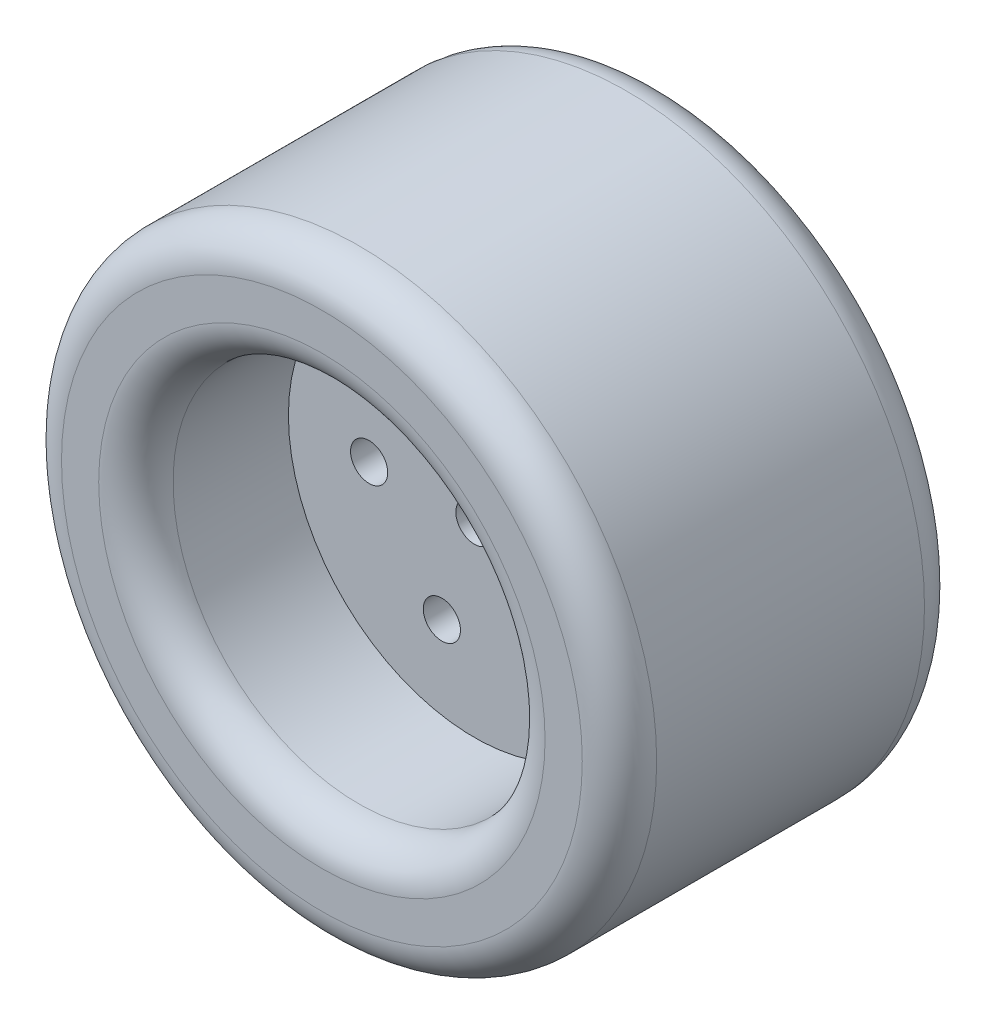
ISO-10303-21;
HEADER;
FILE_DESCRIPTION(('STEP AP214'),'2;1');
FILE_NAME('part.step','',(''),(''),'','','');
FILE_SCHEMA(('AUTOMOTIVE_DESIGN { 1 0 10303 214 1 1 1 1 }'));
ENDSEC;
DATA;
#1=APPLICATION_CONTEXT('core data for automotive mechanical design processes');
#2=APPLICATION_PROTOCOL_DEFINITION('international standard','automotive_design',2000,#1);
#3=PRODUCT_CONTEXT('',#1,'mechanical');
#4=PRODUCT('Part','Part','',(#3));
#5=PRODUCT_RELATED_PRODUCT_CATEGORY('part','',(#4));
#6=PRODUCT_DEFINITION_FORMATION('','',#4);
#7=PRODUCT_DEFINITION_CONTEXT('part definition',#1,'design');
#8=PRODUCT_DEFINITION('design','',#6,#7);
#9=PRODUCT_DEFINITION_SHAPE('','',#8);
#10=(LENGTH_UNIT() NAMED_UNIT(*) SI_UNIT(.MILLI.,.METRE.));
#11=(NAMED_UNIT(*) PLANE_ANGLE_UNIT() SI_UNIT($,.RADIAN.));
#12=(NAMED_UNIT(*) SI_UNIT($,.STERADIAN.) SOLID_ANGLE_UNIT());
#13=UNCERTAINTY_MEASURE_WITH_UNIT(LENGTH_MEASURE(1.E-05),#10,'distance_accuracy_value','');
#14=(GEOMETRIC_REPRESENTATION_CONTEXT(3) GLOBAL_UNCERTAINTY_ASSIGNED_CONTEXT((#13)) GLOBAL_UNIT_ASSIGNED_CONTEXT((#10,
#11,#12)) REPRESENTATION_CONTEXT('',''));
#15=CARTESIAN_POINT('',(0.,0.,0.));
#16=DIRECTION('',(0.,0.,1.));
#17=DIRECTION('',(1.,0.,0.));
#18=AXIS2_PLACEMENT_3D('',#15,#16,#17);
#19=CARTESIAN_POINT('',(0.,0.,-2.54));
#20=DIRECTION('',(0.,0.,1.));
#21=DIRECTION('',(1.,0.,0.));
#22=AXIS2_PLACEMENT_3D('',#19,#20,#21);
#23=CYLINDRICAL_SURFACE('',#22,63.5);
#24=CARTESIAN_POINT('',(0.,0.,101.6));
#25=DIRECTION('',(0.,0.,1.));
#26=DIRECTION('',(1.,0.,0.));
#27=AXIS2_PLACEMENT_3D('',#24,#25,#26);
#28=CIRCLE('',#27,63.5);
#29=CARTESIAN_POINT('',(63.5,0.,101.6));
#30=VERTEX_POINT('',#29);
#31=EDGE_CURVE('E91',#30,#30,#28,.T.);
#32=ORIENTED_EDGE('',*,*,#31,.T.);
#33=EDGE_LOOP('',(#32));
#34=FACE_BOUND('',#33,.T.);
#35=CARTESIAN_POINT('',(0.,0.,62.23));
#36=DIRECTION('',(0.,0.,-1.));
#37=DIRECTION('',(-1.,0.,0.));
#38=AXIS2_PLACEMENT_3D('',#35,#36,#37);
#39=CIRCLE('',#38,63.5);
#40=CARTESIAN_POINT('',(-63.5,0.,62.23));
#41=VERTEX_POINT('',#40);
#42=EDGE_CURVE('E10',#41,#41,#39,.F.);
#43=ORIENTED_EDGE('',*,*,#42,.F.);
#44=EDGE_LOOP('',(#43));
#45=FACE_BOUND('',#44,.T.);
#46=ADVANCED_FACE('F33',(#34,#45),#23,.F.);
#47=CARTESIAN_POINT('',(0.,0.,-2.54));
#48=DIRECTION('',(0.,0.,1.));
#49=DIRECTION('',(1.,0.,0.));
#50=AXIS2_PLACEMENT_3D('',#47,#48,#49);
#51=CYLINDRICAL_SURFACE('',#50,101.6);
#52=CARTESIAN_POINT('',(0.,0.,101.6));
#53=DIRECTION('',(0.,0.,1.));
#54=DIRECTION('',(1.,0.,0.));
#55=AXIS2_PLACEMENT_3D('',#52,#53,#54);
#56=CIRCLE('',#55,101.6);
#57=CARTESIAN_POINT('',(101.6,0.,101.6));
#58=VERTEX_POINT('',#57);
#59=EDGE_CURVE('E41',#58,#58,#56,.F.);
#60=ORIENTED_EDGE('',*,*,#59,.T.);
#61=EDGE_LOOP('',(#60));
#62=FACE_BOUND('',#61,.T.);
#63=CARTESIAN_POINT('',(0.,0.,10.16));
#64=DIRECTION('',(0.,0.,1.));
#65=DIRECTION('',(1.,0.,0.));
#66=AXIS2_PLACEMENT_3D('',#63,#64,#65);
#67=CIRCLE('',#66,101.6);
#68=CARTESIAN_POINT('',(101.6,0.,10.16));
#69=VERTEX_POINT('',#68);
#70=EDGE_CURVE('E46',#69,#69,#67,.T.);
#71=ORIENTED_EDGE('',*,*,#70,.T.);
#72=EDGE_LOOP('',(#71));
#73=FACE_BOUND('',#72,.T.);
#74=ADVANCED_FACE('F105',(#62,#73),#51,.T.);
#75=CARTESIAN_POINT('',(0.,0.,-2.54));
#76=DIRECTION('',(0.,0.,1.));
#77=DIRECTION('',(1.,0.,0.));
#78=AXIS2_PLACEMENT_3D('',#75,#76,#77);
#79=PLANE('',#78);
#80=CARTESIAN_POINT('',(0.,0.,-2.54));
#81=DIRECTION('',(0.,0.,1.));
#82=DIRECTION('',(1.,0.,0.));
#83=AXIS2_PLACEMENT_3D('',#80,#81,#82);
#84=CIRCLE('',#83,76.2);
#85=CARTESIAN_POINT('',(76.2,0.,-2.54));
#86=VERTEX_POINT('',#85);
#87=EDGE_CURVE('E88',#86,#86,#84,.T.);
#88=ORIENTED_EDGE('',*,*,#87,.T.);
#89=EDGE_LOOP('',(#88));
#90=FACE_BOUND('',#89,.T.);
#91=CARTESIAN_POINT('',(0.,0.,-2.54));
#92=DIRECTION('',(0.,0.,1.));
#93=DIRECTION('',(1.,0.,0.));
#94=AXIS2_PLACEMENT_3D('',#91,#92,#93);
#95=CIRCLE('',#94,88.9);
#96=CARTESIAN_POINT('',(88.9,0.,-2.54));
#97=VERTEX_POINT('',#96);
#98=EDGE_CURVE('E85',#97,#97,#95,.F.);
#99=ORIENTED_EDGE('',*,*,#98,.T.);
#100=EDGE_LOOP('',(#99));
#101=FACE_BOUND('',#100,.T.);
#102=ADVANCED_FACE('F128',(#90,#101),#79,.F.);
#103=CARTESIAN_POINT('',(0.,0.,49.53));
#104=DIRECTION('',(0.,0.,-1.));
#105=DIRECTION('',(-1.,0.,0.));
#106=AXIS2_PLACEMENT_3D('',#103,#104,#105);
#107=CIRCLE('',#106,63.5);
#108=CARTESIAN_POINT('',(-63.5,0.,49.53));
#109=VERTEX_POINT('',#108);
#110=EDGE_CURVE('E82',#109,#109,#107,.T.);
#111=ORIENTED_EDGE('',*,*,#110,.F.);
#112=EDGE_LOOP('',(#111));
#113=FACE_BOUND('',#112,.T.);
#114=CARTESIAN_POINT('',(0.,0.,10.16));
#115=DIRECTION('',(0.,0.,1.));
#116=DIRECTION('',(1.,0.,0.));
#117=AXIS2_PLACEMENT_3D('',#114,#115,#116);
#118=CIRCLE('',#117,63.5);
#119=CARTESIAN_POINT('',(63.5,0.,10.16));
#120=VERTEX_POINT('',#119);
#121=EDGE_CURVE('E94',#120,#120,#118,.F.);
#122=ORIENTED_EDGE('',*,*,#121,.T.);
#123=EDGE_LOOP('',(#122));
#124=FACE_BOUND('',#123,.T.);
#125=ADVANCED_FACE('F124',(#113,#124),#23,.F.);
#126=CARTESIAN_POINT('',(0.,0.,114.3));
#127=DIRECTION('',(0.,0.,1.));
#128=DIRECTION('',(1.,0.,0.));
#129=AXIS2_PLACEMENT_3D('',#126,#127,#128);
#130=PLANE('',#129);
#131=CARTESIAN_POINT('',(0.,0.,114.3));
#132=DIRECTION('',(0.,0.,1.));
#133=DIRECTION('',(1.,0.,0.));
#134=AXIS2_PLACEMENT_3D('',#131,#132,#133);
#135=CIRCLE('',#134,76.2);
#136=CARTESIAN_POINT('',(76.2,0.,114.3));
#137=VERTEX_POINT('',#136);
#138=EDGE_CURVE('E100',#137,#137,#135,.F.);
#139=ORIENTED_EDGE('',*,*,#138,.T.);
#140=EDGE_LOOP('',(#139));
#141=FACE_BOUND('',#140,.T.);
#142=CARTESIAN_POINT('',(0.,0.,114.3));
#143=DIRECTION('',(0.,0.,1.));
#144=DIRECTION('',(1.,0.,0.));
#145=AXIS2_PLACEMENT_3D('',#142,#143,#144);
#146=CIRCLE('',#145,88.9);
#147=CARTESIAN_POINT('',(88.9,0.,114.3));
#148=VERTEX_POINT('',#147);
#149=EDGE_CURVE('E97',#148,#148,#146,.T.);
#150=ORIENTED_EDGE('',*,*,#149,.T.);
#151=EDGE_LOOP('',(#150));
#152=FACE_BOUND('',#151,.T.);
#153=ADVANCED_FACE('F135',(#141,#152),#130,.T.);
#154=CARTESIAN_POINT('',(0.,0.,10.16));
#155=DIRECTION('',(0.,0.,1.));
#156=DIRECTION('',(1.,0.,0.));
#157=AXIS2_PLACEMENT_3D('',#154,#155,#156);
#158=TOROIDAL_SURFACE('',#157,76.2,12.7);
#159=ORIENTED_EDGE('',*,*,#121,.F.);
#160=EDGE_LOOP('',(#159));
#161=FACE_BOUND('',#160,.T.);
#162=ORIENTED_EDGE('',*,*,#87,.F.);
#163=EDGE_LOOP('',(#162));
#164=FACE_BOUND('',#163,.T.);
#165=ADVANCED_FACE('F141',(#161,#164),#158,.T.);
#166=CARTESIAN_POINT('',(0.,0.,101.6));
#167=DIRECTION('',(0.,0.,1.));
#168=DIRECTION('',(1.,0.,0.));
#169=AXIS2_PLACEMENT_3D('',#166,#167,#168);
#170=TOROIDAL_SURFACE('',#169,76.2,12.7);
#171=ORIENTED_EDGE('',*,*,#138,.F.);
#172=EDGE_LOOP('',(#171));
#173=FACE_BOUND('',#172,.T.);
#174=ORIENTED_EDGE('',*,*,#31,.F.);
#175=EDGE_LOOP('',(#174));
#176=FACE_BOUND('',#175,.T.);
#177=ADVANCED_FACE('F118',(#173,#176),#170,.T.);
#178=CARTESIAN_POINT('',(0.,0.,101.6));
#179=DIRECTION('',(0.,0.,1.));
#180=DIRECTION('',(1.,0.,0.));
#181=AXIS2_PLACEMENT_3D('',#178,#179,#180);
#182=TOROIDAL_SURFACE('',#181,88.9,12.7);
#183=ORIENTED_EDGE('',*,*,#59,.F.);
#184=EDGE_LOOP('',(#183));
#185=FACE_BOUND('',#184,.T.);
#186=ORIENTED_EDGE('',*,*,#149,.F.);
#187=EDGE_LOOP('',(#186));
#188=FACE_BOUND('',#187,.T.);
#189=ADVANCED_FACE('F109',(#185,#188),#182,.T.);
#190=CARTESIAN_POINT('',(0.,0.,10.16));
#191=DIRECTION('',(0.,0.,1.));
#192=DIRECTION('',(1.,0.,0.));
#193=AXIS2_PLACEMENT_3D('',#190,#191,#192);
#194=TOROIDAL_SURFACE('',#193,88.9,12.7);
#195=ORIENTED_EDGE('',*,*,#98,.F.);
#196=EDGE_LOOP('',(#195));
#197=FACE_BOUND('',#196,.T.);
#198=ORIENTED_EDGE('',*,*,#70,.F.);
#199=EDGE_LOOP('',(#198));
#200=FACE_BOUND('',#199,.T.);
#201=ADVANCED_FACE('F35',(#197,#200),#194,.T.);
#202=CARTESIAN_POINT('',(0.,0.,49.53));
#203=DIRECTION('',(0.,0.,-1.));
#204=DIRECTION('',(-1.,0.,0.));
#205=AXIS2_PLACEMENT_3D('',#202,#203,#204);
#206=PLANE('',#205);
#207=CARTESIAN_POINT('',(-11.10637979483,-34.1819222521643,49.53));
#208=DIRECTION('',(0.,0.,-1.));
#209=DIRECTION('',(-1.,0.,0.));
#210=AXIS2_PLACEMENT_3D('',#207,#208,#209);
#211=CIRCLE('',#210,6.35000000000028);
#212=CARTESIAN_POINT('',(-17.4563797948302,-34.1819222521643,49.53));
#213=VERTEX_POINT('',#212);
#214=EDGE_CURVE('E79',#213,#213,#211,.T.);
#215=ORIENTED_EDGE('',*,*,#214,.F.);
#216=EDGE_LOOP('',(#215));
#217=FACE_BOUND('',#216,.T.);
#218=CARTESIAN_POINT('',(29.0768797948298,-21.125589752644,49.53));
#219=DIRECTION('',(0.,0.,-1.));
#220=DIRECTION('',(-1.,0.,0.));
#221=AXIS2_PLACEMENT_3D('',#218,#219,#220);
#222=CIRCLE('',#221,6.35);
#223=CARTESIAN_POINT('',(22.7268797948298,-21.125589752644,49.53));
#224=VERTEX_POINT('',#223);
#225=EDGE_CURVE('E67',#224,#224,#222,.T.);
#226=ORIENTED_EDGE('',*,*,#225,.F.);
#227=EDGE_LOOP('',(#226));
#228=FACE_BOUND('',#227,.T.);
#229=CARTESIAN_POINT('',(29.0768797948301,21.1255897526436,49.53));
#230=DIRECTION('',(0.,0.,-1.));
#231=DIRECTION('',(-1.,0.,0.));
#232=AXIS2_PLACEMENT_3D('',#229,#230,#231);
#233=CIRCLE('',#232,6.35);
#234=CARTESIAN_POINT('',(22.7268797948301,21.1255897526436,49.53));
#235=VERTEX_POINT('',#234);
#236=EDGE_CURVE('E64',#235,#235,#233,.T.);
#237=ORIENTED_EDGE('',*,*,#236,.F.);
#238=EDGE_LOOP('',(#237));
#239=FACE_BOUND('',#238,.T.);
#240=CARTESIAN_POINT('',(-11.1063797948299,34.1819222521642,49.53));
#241=DIRECTION('',(0.,0.,-1.));
#242=DIRECTION('',(-1.,0.,0.));
#243=AXIS2_PLACEMENT_3D('',#240,#241,#242);
#244=CIRCLE('',#243,6.35);
#245=CARTESIAN_POINT('',(-17.4563797948299,34.1819222521642,49.53));
#246=VERTEX_POINT('',#245);
#247=EDGE_CURVE('E61',#246,#246,#244,.T.);
#248=ORIENTED_EDGE('',*,*,#247,.F.);
#249=EDGE_LOOP('',(#248));
#250=FACE_BOUND('',#249,.T.);
#251=CARTESIAN_POINT('',(-35.941,0.,49.53));
#252=DIRECTION('',(0.,0.,-1.));
#253=DIRECTION('',(-1.,0.,0.));
#254=AXIS2_PLACEMENT_3D('',#251,#252,#253);
#255=CIRCLE('',#254,6.35);
#256=CARTESIAN_POINT('',(-42.291,0.,49.53));
#257=VERTEX_POINT('',#256);
#258=EDGE_CURVE('E57',#257,#257,#255,.T.);
#259=ORIENTED_EDGE('',*,*,#258,.F.);
#260=EDGE_LOOP('',(#259));
#261=FACE_BOUND('',#260,.T.);
#262=CARTESIAN_POINT('',(0.,0.,49.53));
#263=DIRECTION('',(0.,0.,-1.));
#264=DIRECTION('',(-1.,0.,0.));
#265=AXIS2_PLACEMENT_3D('',#262,#263,#264);
#266=CIRCLE('',#265,6.35);
#267=CARTESIAN_POINT('',(-6.35,0.,49.53));
#268=VERTEX_POINT('',#267);
#269=EDGE_CURVE('E53',#268,#268,#266,.T.);
#270=ORIENTED_EDGE('',*,*,#269,.F.);
#271=EDGE_LOOP('',(#270));
#272=FACE_BOUND('',#271,.T.);
#273=ORIENTED_EDGE('',*,*,#110,.T.);
#274=EDGE_LOOP('',(#273));
#275=FACE_BOUND('',#274,.T.);
#276=ADVANCED_FACE('F108',(#217,#228,#239,#250,#261,#272,#275),#206,.T.);
#277=CARTESIAN_POINT('',(0.,0.,62.23));
#278=DIRECTION('',(0.,0.,-1.));
#279=DIRECTION('',(-1.,0.,0.));
#280=AXIS2_PLACEMENT_3D('',#277,#278,#279);
#281=PLANE('',#280);
#282=CARTESIAN_POINT('',(-11.10637979483,-34.1819222521643,62.23));
#283=DIRECTION('',(0.,0.,-1.));
#284=DIRECTION('',(-1.,0.,0.));
#285=AXIS2_PLACEMENT_3D('',#282,#283,#284);
#286=CIRCLE('',#285,6.35000000000028);
#287=CARTESIAN_POINT('',(-17.4563797948302,-34.1819222521643,62.23));
#288=VERTEX_POINT('',#287);
#289=EDGE_CURVE('E37',#288,#288,#286,.T.);
#290=ORIENTED_EDGE('',*,*,#289,.T.);
#291=EDGE_LOOP('',(#290));
#292=FACE_BOUND('',#291,.T.);
#293=CARTESIAN_POINT('',(29.0768797948298,-21.125589752644,62.23));
#294=DIRECTION('',(0.,0.,-1.));
#295=DIRECTION('',(-1.,0.,0.));
#296=AXIS2_PLACEMENT_3D('',#293,#294,#295);
#297=CIRCLE('',#296,6.35);
#298=CARTESIAN_POINT('',(22.7268797948298,-21.125589752644,62.23));
#299=VERTEX_POINT('',#298);
#300=EDGE_CURVE('E65',#299,#299,#297,.T.);
#301=ORIENTED_EDGE('',*,*,#300,.T.);
#302=EDGE_LOOP('',(#301));
#303=FACE_BOUND('',#302,.T.);
#304=CARTESIAN_POINT('',(29.0768797948301,21.1255897526436,62.23));
#305=DIRECTION('',(0.,0.,-1.));
#306=DIRECTION('',(-1.,0.,0.));
#307=AXIS2_PLACEMENT_3D('',#304,#305,#306);
#308=CIRCLE('',#307,6.35);
#309=CARTESIAN_POINT('',(22.7268797948301,21.1255897526436,62.23));
#310=VERTEX_POINT('',#309);
#311=EDGE_CURVE('E62',#310,#310,#308,.T.);
#312=ORIENTED_EDGE('',*,*,#311,.T.);
#313=EDGE_LOOP('',(#312));
#314=FACE_BOUND('',#313,.T.);
#315=CARTESIAN_POINT('',(-11.1063797948299,34.1819222521642,62.23));
#316=DIRECTION('',(0.,0.,-1.));
#317=DIRECTION('',(-1.,0.,0.));
#318=AXIS2_PLACEMENT_3D('',#315,#316,#317);
#319=CIRCLE('',#318,6.35);
#320=CARTESIAN_POINT('',(-17.4563797948299,34.1819222521642,62.23));
#321=VERTEX_POINT('',#320);
#322=EDGE_CURVE('E58',#321,#321,#319,.T.);
#323=ORIENTED_EDGE('',*,*,#322,.T.);
#324=EDGE_LOOP('',(#323));
#325=FACE_BOUND('',#324,.T.);
#326=CARTESIAN_POINT('',(-35.941,0.,62.23));
#327=DIRECTION('',(0.,0.,-1.));
#328=DIRECTION('',(-1.,0.,0.));
#329=AXIS2_PLACEMENT_3D('',#326,#327,#328);
#330=CIRCLE('',#329,6.35);
#331=CARTESIAN_POINT('',(-42.291,0.,62.23));
#332=VERTEX_POINT('',#331);
#333=EDGE_CURVE('E54',#332,#332,#330,.T.);
#334=ORIENTED_EDGE('',*,*,#333,.T.);
#335=EDGE_LOOP('',(#334));
#336=FACE_BOUND('',#335,.T.);
#337=CARTESIAN_POINT('',(0.,0.,62.23));
#338=DIRECTION('',(0.,0.,-1.));
#339=DIRECTION('',(-1.,0.,0.));
#340=AXIS2_PLACEMENT_3D('',#337,#338,#339);
#341=CIRCLE('',#340,6.35);
#342=CARTESIAN_POINT('',(-6.35,0.,62.23));
#343=VERTEX_POINT('',#342);
#344=EDGE_CURVE('E50',#343,#343,#341,.T.);
#345=ORIENTED_EDGE('',*,*,#344,.T.);
#346=EDGE_LOOP('',(#345));
#347=FACE_BOUND('',#346,.T.);
#348=ORIENTED_EDGE('',*,*,#42,.T.);
#349=EDGE_LOOP('',(#348));
#350=FACE_BOUND('',#349,.T.);
#351=ADVANCED_FACE('F115',(#292,#303,#314,#325,#336,#347,#350),#281,.F.);
#352=CARTESIAN_POINT('',(0.,0.,-2.54));
#353=DIRECTION('',(0.,0.,1.));
#354=DIRECTION('',(1.,0.,0.));
#355=AXIS2_PLACEMENT_3D('',#352,#353,#354);
#356=CYLINDRICAL_SURFACE('',#355,6.35);
#357=ORIENTED_EDGE('',*,*,#269,.T.);
#358=EDGE_LOOP('',(#357));
#359=FACE_BOUND('',#358,.T.);
#360=ORIENTED_EDGE('',*,*,#344,.F.);
#361=EDGE_LOOP('',(#360));
#362=FACE_BOUND('',#361,.T.);
#363=ADVANCED_FACE('F195',(#359,#362),#356,.F.);
#364=CARTESIAN_POINT('',(-35.941,0.,-2.54));
#365=DIRECTION('',(0.,0.,1.));
#366=DIRECTION('',(1.,0.,0.));
#367=AXIS2_PLACEMENT_3D('',#364,#365,#366);
#368=CYLINDRICAL_SURFACE('',#367,6.35);
#369=ORIENTED_EDGE('',*,*,#258,.T.);
#370=EDGE_LOOP('',(#369));
#371=FACE_BOUND('',#370,.T.);
#372=ORIENTED_EDGE('',*,*,#333,.F.);
#373=EDGE_LOOP('',(#372));
#374=FACE_BOUND('',#373,.T.);
#375=ADVANCED_FACE('F207',(#371,#374),#368,.F.);
#376=CARTESIAN_POINT('',(-11.1063797948299,34.1819222521642,-2.54));
#377=DIRECTION('',(0.,0.,1.));
#378=DIRECTION('',(1.,0.,0.));
#379=AXIS2_PLACEMENT_3D('',#376,#377,#378);
#380=CYLINDRICAL_SURFACE('',#379,6.35);
#381=ORIENTED_EDGE('',*,*,#247,.T.);
#382=EDGE_LOOP('',(#381));
#383=FACE_BOUND('',#382,.T.);
#384=ORIENTED_EDGE('',*,*,#322,.F.);
#385=EDGE_LOOP('',(#384));
#386=FACE_BOUND('',#385,.T.);
#387=ADVANCED_FACE('F217',(#383,#386),#380,.F.);
#388=CARTESIAN_POINT('',(29.0768797948301,21.1255897526436,-2.54));
#389=DIRECTION('',(0.,0.,1.));
#390=DIRECTION('',(1.,0.,0.));
#391=AXIS2_PLACEMENT_3D('',#388,#389,#390);
#392=CYLINDRICAL_SURFACE('',#391,6.35);
#393=ORIENTED_EDGE('',*,*,#236,.T.);
#394=EDGE_LOOP('',(#393));
#395=FACE_BOUND('',#394,.T.);
#396=ORIENTED_EDGE('',*,*,#311,.F.);
#397=EDGE_LOOP('',(#396));
#398=FACE_BOUND('',#397,.T.);
#399=ADVANCED_FACE('F227',(#395,#398),#392,.F.);
#400=CARTESIAN_POINT('',(29.0768797948298,-21.125589752644,-2.54));
#401=DIRECTION('',(0.,0.,1.));
#402=DIRECTION('',(1.,0.,0.));
#403=AXIS2_PLACEMENT_3D('',#400,#401,#402);
#404=CYLINDRICAL_SURFACE('',#403,6.35);
#405=ORIENTED_EDGE('',*,*,#225,.T.);
#406=EDGE_LOOP('',(#405));
#407=FACE_BOUND('',#406,.T.);
#408=ORIENTED_EDGE('',*,*,#300,.F.);
#409=EDGE_LOOP('',(#408));
#410=FACE_BOUND('',#409,.T.);
#411=ADVANCED_FACE('F237',(#407,#410),#404,.F.);
#412=CARTESIAN_POINT('',(-11.10637979483,-34.1819222521643,-2.54));
#413=DIRECTION('',(0.,0.,1.));
#414=DIRECTION('',(1.,0.,0.));
#415=AXIS2_PLACEMENT_3D('',#412,#413,#414);
#416=CYLINDRICAL_SURFACE('',#415,6.35000000000028);
#417=ORIENTED_EDGE('',*,*,#214,.T.);
#418=EDGE_LOOP('',(#417));
#419=FACE_BOUND('',#418,.T.);
#420=ORIENTED_EDGE('',*,*,#289,.F.);
#421=EDGE_LOOP('',(#420));
#422=FACE_BOUND('',#421,.T.);
#423=ADVANCED_FACE('F246',(#419,#422),#416,.F.);
#424=CLOSED_SHELL('',(#46,#74,#102,#125,#153,#165,#177,#189,#201,#276,#351,#363,#375,#387,#399,
#411,#423));
#425=MANIFOLD_SOLID_BREP('B2',#424);
#426=ADVANCED_BREP_SHAPE_REPRESENTATION('',(#18,#425),#14);
#427=SHAPE_DEFINITION_REPRESENTATION(#9,#426);
ENDSEC;
END-ISO-10303-21;
